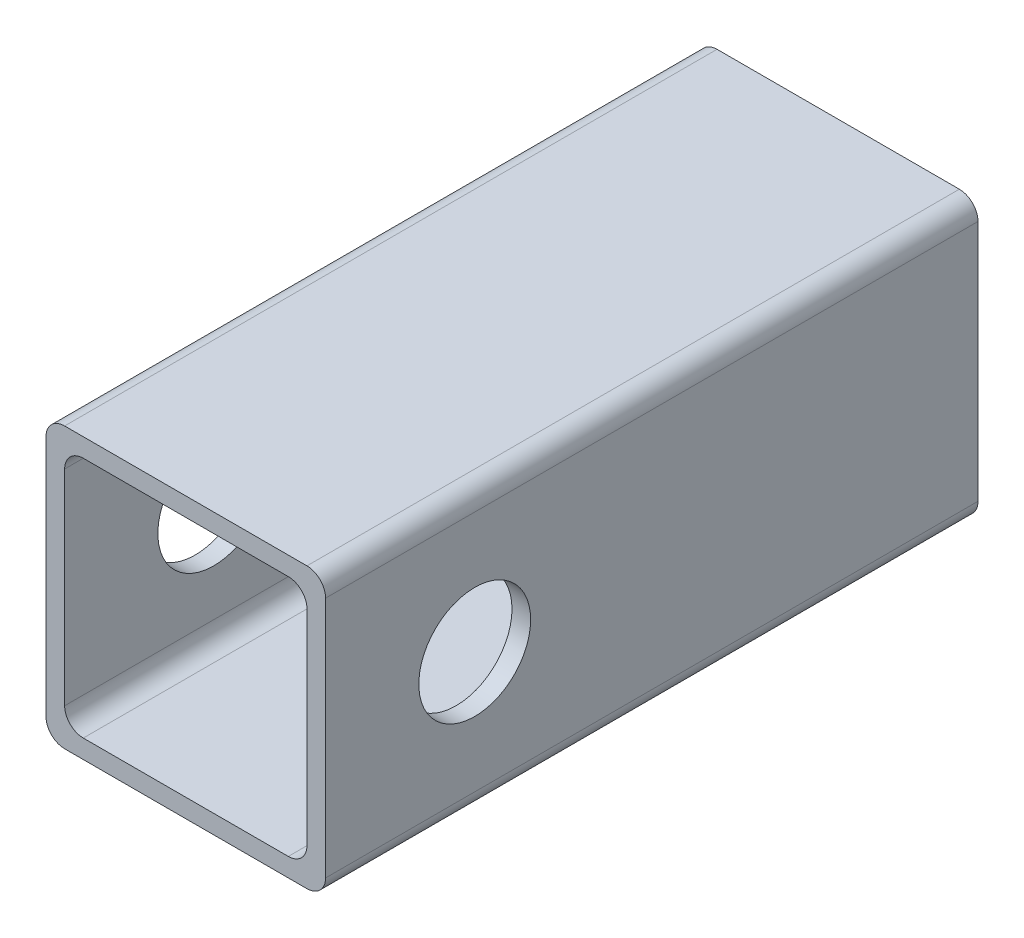
ISO-10303-21;
HEADER;
FILE_DESCRIPTION(('STEP AP214'),'2;1');
FILE_NAME('part.step','',(''),(''),'','','');
FILE_SCHEMA(('AUTOMOTIVE_DESIGN { 1 0 10303 214 1 1 1 1 }'));
ENDSEC;
DATA;
#1=APPLICATION_CONTEXT('core data for automotive mechanical design processes');
#2=APPLICATION_PROTOCOL_DEFINITION('international standard','automotive_design',2000,#1);
#3=PRODUCT_CONTEXT('',#1,'mechanical');
#4=PRODUCT('Part','Part','',(#3));
#5=PRODUCT_RELATED_PRODUCT_CATEGORY('part','',(#4));
#6=PRODUCT_DEFINITION_FORMATION('','',#4);
#7=PRODUCT_DEFINITION_CONTEXT('part definition',#1,'design');
#8=PRODUCT_DEFINITION('design','',#6,#7);
#9=PRODUCT_DEFINITION_SHAPE('','',#8);
#10=(LENGTH_UNIT() NAMED_UNIT(*) SI_UNIT(.MILLI.,.METRE.));
#11=(NAMED_UNIT(*) PLANE_ANGLE_UNIT() SI_UNIT($,.RADIAN.));
#12=(NAMED_UNIT(*) SI_UNIT($,.STERADIAN.) SOLID_ANGLE_UNIT());
#13=UNCERTAINTY_MEASURE_WITH_UNIT(LENGTH_MEASURE(1.E-05),#10,'distance_accuracy_value','');
#14=(GEOMETRIC_REPRESENTATION_CONTEXT(3) GLOBAL_UNCERTAINTY_ASSIGNED_CONTEXT((#13)) GLOBAL_UNIT_ASSIGNED_CONTEXT((#10,
#11,#12)) REPRESENTATION_CONTEXT('',''));
#15=CARTESIAN_POINT('',(0.,0.,0.));
#16=DIRECTION('',(0.,0.,1.));
#17=DIRECTION('',(1.,0.,0.));
#18=AXIS2_PLACEMENT_3D('',#15,#16,#17);
#19=CARTESIAN_POINT('',(2.,2.,70.));
#20=DIRECTION('',(0.,0.,1.));
#21=DIRECTION('',(1.,0.,0.));
#22=AXIS2_PLACEMENT_3D('',#19,#20,#21);
#23=PLANE('',#22);
#24=CARTESIAN_POINT('',(2.,2.,70.));
#25=DIRECTION('',(0.,0.,1.));
#26=DIRECTION('',(1.,0.,0.));
#27=AXIS2_PLACEMENT_3D('',#24,#25,#26);
#28=CIRCLE('',#27,2.);
#29=CARTESIAN_POINT('',(0.,2.00000000000001,70.));
#30=VERTEX_POINT('',#29);
#31=CARTESIAN_POINT('',(2.00000000000001,0.,70.));
#32=VERTEX_POINT('',#31);
#33=EDGE_CURVE('E246',#30,#32,#28,.T.);
#34=ORIENTED_EDGE('',*,*,#33,.T.);
#35=DIRECTION('',(1.,0.,0.));
#36=VECTOR('',#35,1.);
#37=CARTESIAN_POINT('',(2.00000000000001,0.,70.));
#38=LINE('',#37,#36);
#39=CARTESIAN_POINT('',(28.,0.,70.));
#40=VERTEX_POINT('',#39);
#41=EDGE_CURVE('E250',#32,#40,#38,.T.);
#42=ORIENTED_EDGE('',*,*,#41,.T.);
#43=CARTESIAN_POINT('',(28.,2.,70.));
#44=DIRECTION('',(0.,0.,1.));
#45=DIRECTION('',(-1.,0.,0.));
#46=AXIS2_PLACEMENT_3D('',#43,#44,#45);
#47=CIRCLE('',#46,2.);
#48=CARTESIAN_POINT('',(30.,2.00000000000001,70.));
#49=VERTEX_POINT('',#48);
#50=EDGE_CURVE('E254',#40,#49,#47,.T.);
#51=ORIENTED_EDGE('',*,*,#50,.T.);
#52=DIRECTION('',(0.,1.,0.));
#53=VECTOR('',#52,1.);
#54=CARTESIAN_POINT('',(30.,2.00000000000001,70.));
#55=LINE('',#54,#53);
#56=CARTESIAN_POINT('',(30.,28.,70.));
#57=VERTEX_POINT('',#56);
#58=EDGE_CURVE('E257',#49,#57,#55,.T.);
#59=ORIENTED_EDGE('',*,*,#58,.T.);
#60=CARTESIAN_POINT('',(28.,28.,70.));
#61=DIRECTION('',(0.,0.,1.));
#62=DIRECTION('',(-1.,0.,0.));
#63=AXIS2_PLACEMENT_3D('',#60,#61,#62);
#64=CIRCLE('',#63,2.);
#65=CARTESIAN_POINT('',(28.,30.,70.));
#66=VERTEX_POINT('',#65);
#67=EDGE_CURVE('E260',#57,#66,#64,.T.);
#68=ORIENTED_EDGE('',*,*,#67,.T.);
#69=DIRECTION('',(-1.,0.,0.));
#70=VECTOR('',#69,1.);
#71=CARTESIAN_POINT('',(2.00000000000001,30.,70.));
#72=LINE('',#71,#70);
#73=CARTESIAN_POINT('',(2.00000000000001,30.,70.));
#74=VERTEX_POINT('',#73);
#75=EDGE_CURVE('E263',#66,#74,#72,.T.);
#76=ORIENTED_EDGE('',*,*,#75,.T.);
#77=CARTESIAN_POINT('',(2.,28.,70.));
#78=DIRECTION('',(0.,0.,1.));
#79=DIRECTION('',(1.,0.,0.));
#80=AXIS2_PLACEMENT_3D('',#77,#78,#79);
#81=CIRCLE('',#80,2.);
#82=CARTESIAN_POINT('',(0.,28.,70.));
#83=VERTEX_POINT('',#82);
#84=EDGE_CURVE('E266',#74,#83,#81,.T.);
#85=ORIENTED_EDGE('',*,*,#84,.T.);
#86=DIRECTION('',(0.,-1.,0.));
#87=VECTOR('',#86,1.);
#88=CARTESIAN_POINT('',(0.,2.00000000000001,70.));
#89=LINE('',#88,#87);
#90=EDGE_CURVE('E269',#83,#30,#89,.T.);
#91=ORIENTED_EDGE('',*,*,#90,.T.);
#92=EDGE_LOOP('',(#34,#42,#51,#59,#68,#76,#85,#91));
#93=FACE_BOUND('',#92,.T.);
#94=DIRECTION('',(1.,0.,0.));
#95=VECTOR('',#94,1.);
#96=CARTESIAN_POINT('',(4.00000000000001,2.,70.));
#97=LINE('',#96,#95);
#98=CARTESIAN_POINT('',(4.00000000000001,2.,70.));
#99=VERTEX_POINT('',#98);
#100=CARTESIAN_POINT('',(26.,2.,70.));
#101=VERTEX_POINT('',#100);
#102=EDGE_CURVE('E164',#99,#101,#97,.T.);
#103=ORIENTED_EDGE('',*,*,#102,.F.);
#104=CARTESIAN_POINT('',(4.,4.,70.));
#105=DIRECTION('',(0.,0.,1.));
#106=DIRECTION('',(-1.,0.,0.));
#107=AXIS2_PLACEMENT_3D('',#104,#105,#106);
#108=CIRCLE('',#107,2.);
#109=CARTESIAN_POINT('',(2.,4.00000000000001,70.));
#110=VERTEX_POINT('',#109);
#111=EDGE_CURVE('E155',#110,#99,#108,.T.);
#112=ORIENTED_EDGE('',*,*,#111,.F.);
#113=DIRECTION('',(0.,-1.,0.));
#114=VECTOR('',#113,1.);
#115=CARTESIAN_POINT('',(2.,4.00000000000001,70.));
#116=LINE('',#115,#114);
#117=CARTESIAN_POINT('',(2.,26.,70.));
#118=VERTEX_POINT('',#117);
#119=EDGE_CURVE('E197',#118,#110,#116,.T.);
#120=ORIENTED_EDGE('',*,*,#119,.F.);
#121=CARTESIAN_POINT('',(4.,26.,70.));
#122=DIRECTION('',(0.,0.,1.));
#123=DIRECTION('',(1.,0.,0.));
#124=AXIS2_PLACEMENT_3D('',#121,#122,#123);
#125=CIRCLE('',#124,2.);
#126=CARTESIAN_POINT('',(4.00000000000001,28.,70.));
#127=VERTEX_POINT('',#126);
#128=EDGE_CURVE('E194',#127,#118,#125,.T.);
#129=ORIENTED_EDGE('',*,*,#128,.F.);
#130=DIRECTION('',(-1.,0.,0.));
#131=VECTOR('',#130,1.);
#132=CARTESIAN_POINT('',(4.00000000000001,28.,70.));
#133=LINE('',#132,#131);
#134=CARTESIAN_POINT('',(26.,28.,70.));
#135=VERTEX_POINT('',#134);
#136=EDGE_CURVE('E191',#135,#127,#133,.T.);
#137=ORIENTED_EDGE('',*,*,#136,.F.);
#138=CARTESIAN_POINT('',(26.,26.,70.));
#139=DIRECTION('',(0.,0.,1.));
#140=DIRECTION('',(1.,0.,0.));
#141=AXIS2_PLACEMENT_3D('',#138,#139,#140);
#142=CIRCLE('',#141,2.);
#143=CARTESIAN_POINT('',(28.,26.,70.));
#144=VERTEX_POINT('',#143);
#145=EDGE_CURVE('E188',#144,#135,#142,.T.);
#146=ORIENTED_EDGE('',*,*,#145,.F.);
#147=DIRECTION('',(0.,1.,0.));
#148=VECTOR('',#147,1.);
#149=CARTESIAN_POINT('',(28.,4.00000000000001,70.));
#150=LINE('',#149,#148);
#151=CARTESIAN_POINT('',(28.,4.,70.));
#152=VERTEX_POINT('',#151);
#153=EDGE_CURVE('E182',#152,#144,#150,.T.);
#154=ORIENTED_EDGE('',*,*,#153,.F.);
#155=CARTESIAN_POINT('',(26.,4.,70.));
#156=DIRECTION('',(0.,0.,1.));
#157=DIRECTION('',(1.,0.,0.));
#158=AXIS2_PLACEMENT_3D('',#155,#156,#157);
#159=CIRCLE('',#158,2.);
#160=EDGE_CURVE('E178',#101,#152,#159,.T.);
#161=ORIENTED_EDGE('',*,*,#160,.F.);
#162=EDGE_LOOP('',(#103,#112,#120,#129,#137,#146,#154,#161));
#163=FACE_BOUND('',#162,.T.);
#164=ADVANCED_FACE('F40',(#93,#163),#23,.T.);
#165=CARTESIAN_POINT('',(2.,2.,0.));
#166=DIRECTION('',(0.,0.,1.));
#167=DIRECTION('',(1.,0.,0.));
#168=AXIS2_PLACEMENT_3D('',#165,#166,#167);
#169=PLANE('',#168);
#170=CARTESIAN_POINT('',(2.,2.,0.));
#171=DIRECTION('',(0.,0.,1.));
#172=DIRECTION('',(1.,0.,0.));
#173=AXIS2_PLACEMENT_3D('',#170,#171,#172);
#174=CIRCLE('',#173,2.);
#175=CARTESIAN_POINT('',(0.,2.00000000000001,0.));
#176=VERTEX_POINT('',#175);
#177=CARTESIAN_POINT('',(2.00000000000001,0.,0.));
#178=VERTEX_POINT('',#177);
#179=EDGE_CURVE('E173',#176,#178,#174,.T.);
#180=ORIENTED_EDGE('',*,*,#179,.F.);
#181=DIRECTION('',(0.,-1.,0.));
#182=VECTOR('',#181,1.);
#183=CARTESIAN_POINT('',(0.,2.00000000000001,0.));
#184=LINE('',#183,#182);
#185=CARTESIAN_POINT('',(0.,28.,0.));
#186=VERTEX_POINT('',#185);
#187=EDGE_CURVE('E251',#186,#176,#184,.T.);
#188=ORIENTED_EDGE('',*,*,#187,.F.);
#189=CARTESIAN_POINT('',(2.,28.,0.));
#190=DIRECTION('',(0.,0.,1.));
#191=DIRECTION('',(1.,0.,0.));
#192=AXIS2_PLACEMENT_3D('',#189,#190,#191);
#193=CIRCLE('',#192,2.);
#194=CARTESIAN_POINT('',(2.00000000000001,30.,0.));
#195=VERTEX_POINT('',#194);
#196=EDGE_CURVE('E291',#195,#186,#193,.T.);
#197=ORIENTED_EDGE('',*,*,#196,.F.);
#198=DIRECTION('',(-1.,0.,0.));
#199=VECTOR('',#198,1.);
#200=CARTESIAN_POINT('',(2.00000000000001,30.,0.));
#201=LINE('',#200,#199);
#202=CARTESIAN_POINT('',(28.,30.,0.));
#203=VERTEX_POINT('',#202);
#204=EDGE_CURVE('E288',#203,#195,#201,.T.);
#205=ORIENTED_EDGE('',*,*,#204,.F.);
#206=CARTESIAN_POINT('',(28.,28.,0.));
#207=DIRECTION('',(0.,0.,1.));
#208=DIRECTION('',(-1.,0.,0.));
#209=AXIS2_PLACEMENT_3D('',#206,#207,#208);
#210=CIRCLE('',#209,2.);
#211=CARTESIAN_POINT('',(30.,28.,0.));
#212=VERTEX_POINT('',#211);
#213=EDGE_CURVE('E285',#212,#203,#210,.T.);
#214=ORIENTED_EDGE('',*,*,#213,.F.);
#215=DIRECTION('',(0.,1.,0.));
#216=VECTOR('',#215,1.);
#217=CARTESIAN_POINT('',(30.,2.00000000000001,0.));
#218=LINE('',#217,#216);
#219=CARTESIAN_POINT('',(30.,2.00000000000001,0.));
#220=VERTEX_POINT('',#219);
#221=EDGE_CURVE('E282',#220,#212,#218,.T.);
#222=ORIENTED_EDGE('',*,*,#221,.F.);
#223=CARTESIAN_POINT('',(28.,2.,0.));
#224=DIRECTION('',(0.,0.,1.));
#225=DIRECTION('',(-1.,0.,0.));
#226=AXIS2_PLACEMENT_3D('',#223,#224,#225);
#227=CIRCLE('',#226,2.);
#228=CARTESIAN_POINT('',(28.,0.,0.));
#229=VERTEX_POINT('',#228);
#230=EDGE_CURVE('E279',#229,#220,#227,.T.);
#231=ORIENTED_EDGE('',*,*,#230,.F.);
#232=DIRECTION('',(1.,0.,0.));
#233=VECTOR('',#232,1.);
#234=CARTESIAN_POINT('',(2.00000000000001,0.,0.));
#235=LINE('',#234,#233);
#236=EDGE_CURVE('E276',#178,#229,#235,.T.);
#237=ORIENTED_EDGE('',*,*,#236,.F.);
#238=EDGE_LOOP('',(#180,#188,#197,#205,#214,#222,#231,#237));
#239=FACE_BOUND('',#238,.T.);
#240=CARTESIAN_POINT('',(4.,4.,0.));
#241=DIRECTION('',(0.,0.,1.));
#242=DIRECTION('',(-1.,0.,0.));
#243=AXIS2_PLACEMENT_3D('',#240,#241,#242);
#244=CIRCLE('',#243,2.);
#245=CARTESIAN_POINT('',(2.,4.00000000000001,0.));
#246=VERTEX_POINT('',#245);
#247=CARTESIAN_POINT('',(4.00000000000001,2.,0.));
#248=VERTEX_POINT('',#247);
#249=EDGE_CURVE('E65',#246,#248,#244,.T.);
#250=ORIENTED_EDGE('',*,*,#249,.T.);
#251=DIRECTION('',(1.,0.,0.));
#252=VECTOR('',#251,1.);
#253=CARTESIAN_POINT('',(4.00000000000001,2.,0.));
#254=LINE('',#253,#252);
#255=CARTESIAN_POINT('',(26.,2.,0.));
#256=VERTEX_POINT('',#255);
#257=EDGE_CURVE('E171',#248,#256,#254,.T.);
#258=ORIENTED_EDGE('',*,*,#257,.T.);
#259=CARTESIAN_POINT('',(26.,4.,0.));
#260=DIRECTION('',(0.,0.,1.));
#261=DIRECTION('',(1.,0.,0.));
#262=AXIS2_PLACEMENT_3D('',#259,#260,#261);
#263=CIRCLE('',#262,2.);
#264=CARTESIAN_POINT('',(28.,4.,0.));
#265=VERTEX_POINT('',#264);
#266=EDGE_CURVE('E205',#256,#265,#263,.T.);
#267=ORIENTED_EDGE('',*,*,#266,.T.);
#268=DIRECTION('',(0.,1.,0.));
#269=VECTOR('',#268,1.);
#270=CARTESIAN_POINT('',(28.,4.00000000000001,0.));
#271=LINE('',#270,#269);
#272=CARTESIAN_POINT('',(28.,26.,0.));
#273=VERTEX_POINT('',#272);
#274=EDGE_CURVE('E209',#265,#273,#271,.T.);
#275=ORIENTED_EDGE('',*,*,#274,.T.);
#276=CARTESIAN_POINT('',(26.,26.,0.));
#277=DIRECTION('',(0.,0.,1.));
#278=DIRECTION('',(1.,0.,0.));
#279=AXIS2_PLACEMENT_3D('',#276,#277,#278);
#280=CIRCLE('',#279,2.);
#281=CARTESIAN_POINT('',(26.,28.,0.));
#282=VERTEX_POINT('',#281);
#283=EDGE_CURVE('E213',#273,#282,#280,.T.);
#284=ORIENTED_EDGE('',*,*,#283,.T.);
#285=DIRECTION('',(-1.,0.,0.));
#286=VECTOR('',#285,1.);
#287=CARTESIAN_POINT('',(4.00000000000001,28.,0.));
#288=LINE('',#287,#286);
#289=CARTESIAN_POINT('',(4.00000000000001,28.,0.));
#290=VERTEX_POINT('',#289);
#291=EDGE_CURVE('E217',#282,#290,#288,.T.);
#292=ORIENTED_EDGE('',*,*,#291,.T.);
#293=CARTESIAN_POINT('',(4.,26.,0.));
#294=DIRECTION('',(0.,0.,1.));
#295=DIRECTION('',(1.,0.,0.));
#296=AXIS2_PLACEMENT_3D('',#293,#294,#295);
#297=CIRCLE('',#296,2.);
#298=CARTESIAN_POINT('',(2.,26.,0.));
#299=VERTEX_POINT('',#298);
#300=EDGE_CURVE('E221',#290,#299,#297,.T.);
#301=ORIENTED_EDGE('',*,*,#300,.T.);
#302=DIRECTION('',(0.,-1.,0.));
#303=VECTOR('',#302,1.);
#304=CARTESIAN_POINT('',(2.,4.00000000000001,0.));
#305=LINE('',#304,#303);
#306=EDGE_CURVE('E165',#299,#246,#305,.T.);
#307=ORIENTED_EDGE('',*,*,#306,.T.);
#308=EDGE_LOOP('',(#250,#258,#267,#275,#284,#292,#301,#307));
#309=FACE_BOUND('',#308,.T.);
#310=ADVANCED_FACE('F331',(#239,#309),#169,.F.);
#311=CARTESIAN_POINT('',(2.,2.,70.));
#312=DIRECTION('',(0.,0.,-1.));
#313=DIRECTION('',(-1.,0.,0.));
#314=AXIS2_PLACEMENT_3D('',#311,#312,#313);
#315=CYLINDRICAL_SURFACE('',#314,2.);
#316=ORIENTED_EDGE('',*,*,#179,.T.);
#317=DIRECTION('',(0.,0.,-1.));
#318=VECTOR('',#317,1.);
#319=CARTESIAN_POINT('',(2.00000000000001,0.,70.));
#320=LINE('',#319,#318);
#321=EDGE_CURVE('E11',#32,#178,#320,.T.);
#322=ORIENTED_EDGE('',*,*,#321,.F.);
#323=ORIENTED_EDGE('',*,*,#33,.F.);
#324=DIRECTION('',(0.,0.,-1.));
#325=VECTOR('',#324,1.);
#326=CARTESIAN_POINT('',(0.,2.00000000000001,70.));
#327=LINE('',#326,#325);
#328=EDGE_CURVE('E272',#30,#176,#327,.T.);
#329=ORIENTED_EDGE('',*,*,#328,.T.);
#330=EDGE_LOOP('',(#316,#322,#323,#329));
#331=FACE_BOUND('',#330,.T.);
#332=ADVANCED_FACE('F42',(#331),#315,.T.);
#333=CARTESIAN_POINT('',(2.00000000000001,0.,70.));
#334=DIRECTION('',(0.,1.,0.));
#335=DIRECTION('',(0.,0.,1.));
#336=AXIS2_PLACEMENT_3D('',#333,#334,#335);
#337=PLANE('',#336);
#338=ORIENTED_EDGE('',*,*,#236,.T.);
#339=DIRECTION('',(0.,0.,-1.));
#340=VECTOR('',#339,1.);
#341=CARTESIAN_POINT('',(28.,0.,70.));
#342=LINE('',#341,#340);
#343=EDGE_CURVE('E50',#40,#229,#342,.T.);
#344=ORIENTED_EDGE('',*,*,#343,.F.);
#345=ORIENTED_EDGE('',*,*,#41,.F.);
#346=ORIENTED_EDGE('',*,*,#321,.T.);
#347=EDGE_LOOP('',(#338,#344,#345,#346));
#348=FACE_BOUND('',#347,.T.);
#349=ADVANCED_FACE('F348',(#348),#337,.F.);
#350=CARTESIAN_POINT('',(28.,2.,70.));
#351=DIRECTION('',(0.,0.,-1.));
#352=DIRECTION('',(-1.,0.,0.));
#353=AXIS2_PLACEMENT_3D('',#350,#351,#352);
#354=CYLINDRICAL_SURFACE('',#353,2.);
#355=ORIENTED_EDGE('',*,*,#230,.T.);
#356=DIRECTION('',(0.,0.,-1.));
#357=VECTOR('',#356,1.);
#358=CARTESIAN_POINT('',(30.,2.00000000000001,70.));
#359=LINE('',#358,#357);
#360=EDGE_CURVE('E315',#49,#220,#359,.T.);
#361=ORIENTED_EDGE('',*,*,#360,.F.);
#362=ORIENTED_EDGE('',*,*,#50,.F.);
#363=ORIENTED_EDGE('',*,*,#343,.T.);
#364=EDGE_LOOP('',(#355,#361,#362,#363));
#365=FACE_BOUND('',#364,.T.);
#366=ADVANCED_FACE('F325',(#365),#354,.T.);
#367=CARTESIAN_POINT('',(30.,2.00000000000001,70.));
#368=DIRECTION('',(-1.,0.,0.));
#369=DIRECTION('',(0.,0.,1.));
#370=AXIS2_PLACEMENT_3D('',#367,#368,#369);
#371=PLANE('',#370);
#372=CARTESIAN_POINT('',(30.,15.,54.));
#373=DIRECTION('',(1.,0.,0.));
#374=DIRECTION('',(0.,0.,-1.));
#375=AXIS2_PLACEMENT_3D('',#372,#373,#374);
#376=CIRCLE('',#375,5.99999999999999);
#377=CARTESIAN_POINT('',(30.,15.,48.));
#378=VERTEX_POINT('',#377);
#379=EDGE_CURVE('E393',#378,#378,#376,.T.);
#380=ORIENTED_EDGE('',*,*,#379,.F.);
#381=EDGE_LOOP('',(#380));
#382=FACE_BOUND('',#381,.T.);
#383=ORIENTED_EDGE('',*,*,#221,.T.);
#384=DIRECTION('',(0.,0.,-1.));
#385=VECTOR('',#384,1.);
#386=CARTESIAN_POINT('',(30.,28.,70.));
#387=LINE('',#386,#385);
#388=EDGE_CURVE('E311',#57,#212,#387,.T.);
#389=ORIENTED_EDGE('',*,*,#388,.F.);
#390=ORIENTED_EDGE('',*,*,#58,.F.);
#391=ORIENTED_EDGE('',*,*,#360,.T.);
#392=EDGE_LOOP('',(#383,#389,#390,#391));
#393=FACE_BOUND('',#392,.T.);
#394=ADVANCED_FACE('F337',(#382,#393),#371,.F.);
#395=CARTESIAN_POINT('',(28.,28.,70.));
#396=DIRECTION('',(0.,0.,-1.));
#397=DIRECTION('',(-1.,0.,0.));
#398=AXIS2_PLACEMENT_3D('',#395,#396,#397);
#399=CYLINDRICAL_SURFACE('',#398,2.);
#400=ORIENTED_EDGE('',*,*,#213,.T.);
#401=DIRECTION('',(0.,0.,-1.));
#402=VECTOR('',#401,1.);
#403=CARTESIAN_POINT('',(28.,30.,70.));
#404=LINE('',#403,#402);
#405=EDGE_CURVE('E307',#66,#203,#404,.T.);
#406=ORIENTED_EDGE('',*,*,#405,.F.);
#407=ORIENTED_EDGE('',*,*,#67,.F.);
#408=ORIENTED_EDGE('',*,*,#388,.T.);
#409=EDGE_LOOP('',(#400,#406,#407,#408));
#410=FACE_BOUND('',#409,.T.);
#411=ADVANCED_FACE('F341',(#410),#399,.T.);
#412=CARTESIAN_POINT('',(2.00000000000001,30.,70.));
#413=DIRECTION('',(0.,-1.,0.));
#414=DIRECTION('',(0.,0.,-1.));
#415=AXIS2_PLACEMENT_3D('',#412,#413,#414);
#416=PLANE('',#415);
#417=ORIENTED_EDGE('',*,*,#204,.T.);
#418=DIRECTION('',(0.,0.,-1.));
#419=VECTOR('',#418,1.);
#420=CARTESIAN_POINT('',(2.00000000000001,30.,70.));
#421=LINE('',#420,#419);
#422=EDGE_CURVE('E303',#74,#195,#421,.T.);
#423=ORIENTED_EDGE('',*,*,#422,.F.);
#424=ORIENTED_EDGE('',*,*,#75,.F.);
#425=ORIENTED_EDGE('',*,*,#405,.T.);
#426=EDGE_LOOP('',(#417,#423,#424,#425));
#427=FACE_BOUND('',#426,.T.);
#428=ADVANCED_FACE('F361',(#427),#416,.F.);
#429=CARTESIAN_POINT('',(2.,28.,70.));
#430=DIRECTION('',(0.,0.,-1.));
#431=DIRECTION('',(-1.,0.,0.));
#432=AXIS2_PLACEMENT_3D('',#429,#430,#431);
#433=CYLINDRICAL_SURFACE('',#432,2.);
#434=ORIENTED_EDGE('',*,*,#196,.T.);
#435=DIRECTION('',(0.,0.,-1.));
#436=VECTOR('',#435,1.);
#437=CARTESIAN_POINT('',(0.,28.,70.));
#438=LINE('',#437,#436);
#439=EDGE_CURVE('E299',#83,#186,#438,.T.);
#440=ORIENTED_EDGE('',*,*,#439,.F.);
#441=ORIENTED_EDGE('',*,*,#84,.F.);
#442=ORIENTED_EDGE('',*,*,#422,.T.);
#443=EDGE_LOOP('',(#434,#440,#441,#442));
#444=FACE_BOUND('',#443,.T.);
#445=ADVANCED_FACE('F359',(#444),#433,.T.);
#446=CARTESIAN_POINT('',(0.,2.00000000000001,70.));
#447=DIRECTION('',(1.,0.,0.));
#448=DIRECTION('',(0.,0.,-1.));
#449=AXIS2_PLACEMENT_3D('',#446,#447,#448);
#450=PLANE('',#449);
#451=CARTESIAN_POINT('',(0.,15.,54.));
#452=DIRECTION('',(1.,0.,0.));
#453=DIRECTION('',(0.,0.,-1.));
#454=AXIS2_PLACEMENT_3D('',#451,#452,#453);
#455=CIRCLE('',#454,5.99999999999999);
#456=CARTESIAN_POINT('',(0.,15.,48.));
#457=VERTEX_POINT('',#456);
#458=EDGE_CURVE('E202',#457,#457,#455,.T.);
#459=ORIENTED_EDGE('',*,*,#458,.T.);
#460=EDGE_LOOP('',(#459));
#461=FACE_BOUND('',#460,.T.);
#462=ORIENTED_EDGE('',*,*,#187,.T.);
#463=ORIENTED_EDGE('',*,*,#328,.F.);
#464=ORIENTED_EDGE('',*,*,#90,.F.);
#465=ORIENTED_EDGE('',*,*,#439,.T.);
#466=EDGE_LOOP('',(#462,#463,#464,#465));
#467=FACE_BOUND('',#466,.T.);
#468=ADVANCED_FACE('F354',(#461,#467),#450,.F.);
#469=CARTESIAN_POINT('',(4.,4.,70.));
#470=DIRECTION('',(0.,0.,-1.));
#471=DIRECTION('',(-1.,0.,0.));
#472=AXIS2_PLACEMENT_3D('',#469,#470,#471);
#473=CYLINDRICAL_SURFACE('',#472,2.);
#474=ORIENTED_EDGE('',*,*,#249,.F.);
#475=DIRECTION('',(0.,0.,-1.));
#476=VECTOR('',#475,1.);
#477=CARTESIAN_POINT('',(2.,4.00000000000001,70.));
#478=LINE('',#477,#476);
#479=EDGE_CURVE('E159',#110,#246,#478,.T.);
#480=ORIENTED_EDGE('',*,*,#479,.F.);
#481=ORIENTED_EDGE('',*,*,#111,.T.);
#482=DIRECTION('',(0.,0.,-1.));
#483=VECTOR('',#482,1.);
#484=CARTESIAN_POINT('',(4.00000000000001,2.,70.));
#485=LINE('',#484,#483);
#486=EDGE_CURVE('E158',#99,#248,#485,.T.);
#487=ORIENTED_EDGE('',*,*,#486,.T.);
#488=EDGE_LOOP('',(#474,#480,#481,#487));
#489=FACE_BOUND('',#488,.T.);
#490=ADVANCED_FACE('F157',(#489),#473,.F.);
#491=CARTESIAN_POINT('',(4.00000000000001,2.,70.));
#492=DIRECTION('',(0.,1.,0.));
#493=DIRECTION('',(0.,0.,1.));
#494=AXIS2_PLACEMENT_3D('',#491,#492,#493);
#495=PLANE('',#494);
#496=ORIENTED_EDGE('',*,*,#257,.F.);
#497=ORIENTED_EDGE('',*,*,#486,.F.);
#498=ORIENTED_EDGE('',*,*,#102,.T.);
#499=DIRECTION('',(0.,0.,-1.));
#500=VECTOR('',#499,1.);
#501=CARTESIAN_POINT('',(26.,2.,70.));
#502=LINE('',#501,#500);
#503=EDGE_CURVE('E174',#101,#256,#502,.T.);
#504=ORIENTED_EDGE('',*,*,#503,.T.);
#505=EDGE_LOOP('',(#496,#497,#498,#504));
#506=FACE_BOUND('',#505,.T.);
#507=ADVANCED_FACE('F168',(#506),#495,.T.);
#508=CARTESIAN_POINT('',(26.,4.,70.));
#509=DIRECTION('',(0.,0.,-1.));
#510=DIRECTION('',(-1.,0.,0.));
#511=AXIS2_PLACEMENT_3D('',#508,#509,#510);
#512=CYLINDRICAL_SURFACE('',#511,2.);
#513=ORIENTED_EDGE('',*,*,#266,.F.);
#514=ORIENTED_EDGE('',*,*,#503,.F.);
#515=ORIENTED_EDGE('',*,*,#160,.T.);
#516=DIRECTION('',(0.,0.,-1.));
#517=VECTOR('',#516,1.);
#518=CARTESIAN_POINT('',(28.,4.,70.));
#519=LINE('',#518,#517);
#520=EDGE_CURVE('E241',#152,#265,#519,.T.);
#521=ORIENTED_EDGE('',*,*,#520,.T.);
#522=EDGE_LOOP('',(#513,#514,#515,#521));
#523=FACE_BOUND('',#522,.T.);
#524=ADVANCED_FACE('F428',(#523),#512,.F.);
#525=CARTESIAN_POINT('',(28.,4.00000000000001,70.));
#526=DIRECTION('',(-1.,0.,0.));
#527=DIRECTION('',(0.,0.,1.));
#528=AXIS2_PLACEMENT_3D('',#525,#526,#527);
#529=PLANE('',#528);
#530=CARTESIAN_POINT('',(28.,15.,54.));
#531=DIRECTION('',(-1.,0.,0.));
#532=DIRECTION('',(0.,0.,1.));
#533=AXIS2_PLACEMENT_3D('',#530,#531,#532);
#534=CIRCLE('',#533,5.99999999999999);
#535=CARTESIAN_POINT('',(28.,15.,60.));
#536=VERTEX_POINT('',#535);
#537=EDGE_CURVE('E388',#536,#536,#534,.T.);
#538=ORIENTED_EDGE('',*,*,#537,.F.);
#539=EDGE_LOOP('',(#538));
#540=FACE_BOUND('',#539,.T.);
#541=ORIENTED_EDGE('',*,*,#274,.F.);
#542=ORIENTED_EDGE('',*,*,#520,.F.);
#543=ORIENTED_EDGE('',*,*,#153,.T.);
#544=DIRECTION('',(0.,0.,-1.));
#545=VECTOR('',#544,1.);
#546=CARTESIAN_POINT('',(28.,26.,70.));
#547=LINE('',#546,#545);
#548=EDGE_CURVE('E238',#144,#273,#547,.T.);
#549=ORIENTED_EDGE('',*,*,#548,.T.);
#550=EDGE_LOOP('',(#541,#542,#543,#549));
#551=FACE_BOUND('',#550,.T.);
#552=ADVANCED_FACE('F424',(#540,#551),#529,.T.);
#553=CARTESIAN_POINT('',(26.,26.,70.));
#554=DIRECTION('',(0.,0.,-1.));
#555=DIRECTION('',(-1.,0.,0.));
#556=AXIS2_PLACEMENT_3D('',#553,#554,#555);
#557=CYLINDRICAL_SURFACE('',#556,2.);
#558=ORIENTED_EDGE('',*,*,#283,.F.);
#559=ORIENTED_EDGE('',*,*,#548,.F.);
#560=ORIENTED_EDGE('',*,*,#145,.T.);
#561=DIRECTION('',(0.,0.,-1.));
#562=VECTOR('',#561,1.);
#563=CARTESIAN_POINT('',(26.,28.,70.));
#564=LINE('',#563,#562);
#565=EDGE_CURVE('E235',#135,#282,#564,.T.);
#566=ORIENTED_EDGE('',*,*,#565,.T.);
#567=EDGE_LOOP('',(#558,#559,#560,#566));
#568=FACE_BOUND('',#567,.T.);
#569=ADVANCED_FACE('F420',(#568),#557,.F.);
#570=CARTESIAN_POINT('',(4.00000000000001,28.,70.));
#571=DIRECTION('',(0.,-1.,0.));
#572=DIRECTION('',(0.,0.,-1.));
#573=AXIS2_PLACEMENT_3D('',#570,#571,#572);
#574=PLANE('',#573);
#575=ORIENTED_EDGE('',*,*,#291,.F.);
#576=ORIENTED_EDGE('',*,*,#565,.F.);
#577=ORIENTED_EDGE('',*,*,#136,.T.);
#578=DIRECTION('',(0.,0.,-1.));
#579=VECTOR('',#578,1.);
#580=CARTESIAN_POINT('',(4.00000000000001,28.,70.));
#581=LINE('',#580,#579);
#582=EDGE_CURVE('E232',#127,#290,#581,.T.);
#583=ORIENTED_EDGE('',*,*,#582,.T.);
#584=EDGE_LOOP('',(#575,#576,#577,#583));
#585=FACE_BOUND('',#584,.T.);
#586=ADVANCED_FACE('F417',(#585),#574,.T.);
#587=CARTESIAN_POINT('',(4.,26.,70.));
#588=DIRECTION('',(0.,0.,-1.));
#589=DIRECTION('',(-1.,0.,0.));
#590=AXIS2_PLACEMENT_3D('',#587,#588,#589);
#591=CYLINDRICAL_SURFACE('',#590,2.);
#592=ORIENTED_EDGE('',*,*,#300,.F.);
#593=ORIENTED_EDGE('',*,*,#582,.F.);
#594=ORIENTED_EDGE('',*,*,#128,.T.);
#595=DIRECTION('',(0.,0.,-1.));
#596=VECTOR('',#595,1.);
#597=CARTESIAN_POINT('',(2.,26.,70.));
#598=LINE('',#597,#596);
#599=EDGE_CURVE('E57',#118,#299,#598,.T.);
#600=ORIENTED_EDGE('',*,*,#599,.T.);
#601=EDGE_LOOP('',(#592,#593,#594,#600));
#602=FACE_BOUND('',#601,.T.);
#603=ADVANCED_FACE('F406',(#602),#591,.F.);
#604=CARTESIAN_POINT('',(2.,4.00000000000001,70.));
#605=DIRECTION('',(1.,0.,0.));
#606=DIRECTION('',(0.,0.,-1.));
#607=AXIS2_PLACEMENT_3D('',#604,#605,#606);
#608=PLANE('',#607);
#609=CARTESIAN_POINT('',(2.,15.,54.));
#610=DIRECTION('',(1.,0.,0.));
#611=DIRECTION('',(0.,0.,-1.));
#612=AXIS2_PLACEMENT_3D('',#609,#610,#611);
#613=CIRCLE('',#612,5.99999999999999);
#614=CARTESIAN_POINT('',(2.,15.,48.));
#615=VERTEX_POINT('',#614);
#616=EDGE_CURVE('E44',#615,#615,#613,.T.);
#617=ORIENTED_EDGE('',*,*,#616,.F.);
#618=EDGE_LOOP('',(#617));
#619=FACE_BOUND('',#618,.T.);
#620=ORIENTED_EDGE('',*,*,#306,.F.);
#621=ORIENTED_EDGE('',*,*,#599,.F.);
#622=ORIENTED_EDGE('',*,*,#119,.T.);
#623=ORIENTED_EDGE('',*,*,#479,.T.);
#624=EDGE_LOOP('',(#620,#621,#622,#623));
#625=FACE_BOUND('',#624,.T.);
#626=ADVANCED_FACE('F404',(#619,#625),#608,.T.);
#627=CARTESIAN_POINT('',(-70.,15.,54.));
#628=DIRECTION('',(1.,0.,0.));
#629=DIRECTION('',(0.,0.,-1.));
#630=AXIS2_PLACEMENT_3D('',#627,#628,#629);
#631=CYLINDRICAL_SURFACE('',#630,5.99999999999999);
#632=ORIENTED_EDGE('',*,*,#616,.T.);
#633=EDGE_LOOP('',(#632));
#634=FACE_BOUND('',#633,.T.);
#635=ORIENTED_EDGE('',*,*,#458,.F.);
#636=EDGE_LOOP('',(#635));
#637=FACE_BOUND('',#636,.T.);
#638=ADVANCED_FACE('F402',(#634,#637),#631,.F.);
#639=ORIENTED_EDGE('',*,*,#537,.T.);
#640=EDGE_LOOP('',(#639));
#641=FACE_BOUND('',#640,.T.);
#642=ORIENTED_EDGE('',*,*,#379,.T.);
#643=EDGE_LOOP('',(#642));
#644=FACE_BOUND('',#643,.T.);
#645=ADVANCED_FACE('F445',(#641,#644),#631,.F.);
#646=CLOSED_SHELL('',(#164,#310,#332,#349,#366,#394,#411,#428,#445,#468,#490,#507,#524,#552,
#569,#586,#603,#626,#638,#645));
#647=MANIFOLD_SOLID_BREP('B2',#646);
#648=ADVANCED_BREP_SHAPE_REPRESENTATION('',(#18,#647),#14);
#649=SHAPE_DEFINITION_REPRESENTATION(#9,#648);
ENDSEC;
END-ISO-10303-21;
